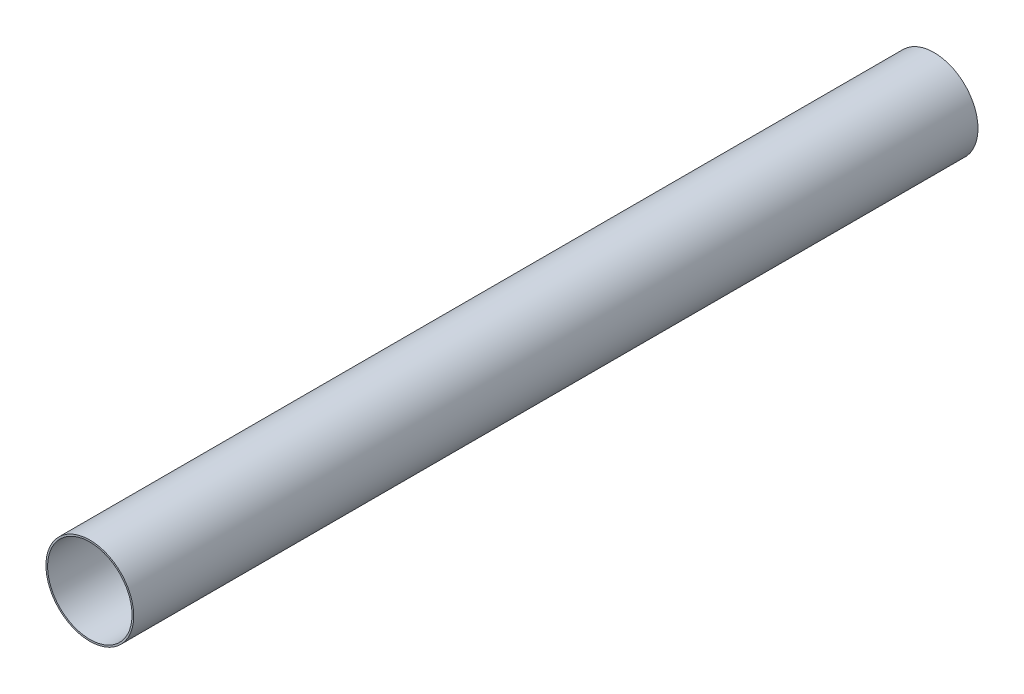
ISO-10303-21;
HEADER;
FILE_DESCRIPTION(('STEP AP214'),'2;1');
FILE_NAME('part.step','',(''),(''),'','','');
FILE_SCHEMA(('AUTOMOTIVE_DESIGN { 1 0 10303 214 1 1 1 1 }'));
ENDSEC;
DATA;
#1=APPLICATION_CONTEXT('core data for automotive mechanical design processes');
#2=APPLICATION_PROTOCOL_DEFINITION('international standard','automotive_design',2000,#1);
#3=PRODUCT_CONTEXT('',#1,'mechanical');
#4=PRODUCT('Part','Part','',(#3));
#5=PRODUCT_RELATED_PRODUCT_CATEGORY('part','',(#4));
#6=PRODUCT_DEFINITION_FORMATION('','',#4);
#7=PRODUCT_DEFINITION_CONTEXT('part definition',#1,'design');
#8=PRODUCT_DEFINITION('design','',#6,#7);
#9=PRODUCT_DEFINITION_SHAPE('','',#8);
#10=(LENGTH_UNIT() NAMED_UNIT(*) SI_UNIT(.MILLI.,.METRE.));
#11=(NAMED_UNIT(*) PLANE_ANGLE_UNIT() SI_UNIT($,.RADIAN.));
#12=(NAMED_UNIT(*) SI_UNIT($,.STERADIAN.) SOLID_ANGLE_UNIT());
#13=UNCERTAINTY_MEASURE_WITH_UNIT(LENGTH_MEASURE(1.E-05),#10,'distance_accuracy_value','');
#14=(GEOMETRIC_REPRESENTATION_CONTEXT(3) GLOBAL_UNCERTAINTY_ASSIGNED_CONTEXT((#13)) GLOBAL_UNIT_ASSIGNED_CONTEXT((#10,
#11,#12)) REPRESENTATION_CONTEXT('',''));
#15=CARTESIAN_POINT('',(0.,0.,0.));
#16=DIRECTION('',(0.,0.,1.));
#17=DIRECTION('',(1.,0.,0.));
#18=AXIS2_PLACEMENT_3D('',#15,#16,#17);
#19=CARTESIAN_POINT('',(0.,0.,1000.));
#20=DIRECTION('',(0.,0.,1.));
#21=DIRECTION('',(1.,0.,0.));
#22=AXIS2_PLACEMENT_3D('',#19,#20,#21);
#23=PLANE('',#22);
#24=CARTESIAN_POINT('',(0.,0.,1000.));
#25=DIRECTION('',(0.,0.,1.));
#26=DIRECTION('',(1.,0.,0.));
#27=AXIS2_PLACEMENT_3D('',#24,#25,#26);
#28=CIRCLE('',#27,52.);
#29=CARTESIAN_POINT('',(52.,0.,1000.));
#30=VERTEX_POINT('',#29);
#31=EDGE_CURVE('E10',#30,#30,#28,.T.);
#32=ORIENTED_EDGE('',*,*,#31,.T.);
#33=EDGE_LOOP('',(#32));
#34=FACE_BOUND('',#33,.T.);
#35=CARTESIAN_POINT('',(0.,0.,1000.));
#36=DIRECTION('',(0.,0.,1.));
#37=DIRECTION('',(1.,0.,0.));
#38=AXIS2_PLACEMENT_3D('',#35,#36,#37);
#39=CIRCLE('',#38,50.);
#40=CARTESIAN_POINT('',(50.,0.,1000.));
#41=VERTEX_POINT('',#40);
#42=EDGE_CURVE('E46',#41,#41,#39,.T.);
#43=ORIENTED_EDGE('',*,*,#42,.F.);
#44=EDGE_LOOP('',(#43));
#45=FACE_BOUND('',#44,.T.);
#46=ADVANCED_FACE('F35',(#34,#45),#23,.T.);
#47=CARTESIAN_POINT('',(0.,0.,0.));
#48=DIRECTION('',(0.,0.,1.));
#49=DIRECTION('',(1.,0.,0.));
#50=AXIS2_PLACEMENT_3D('',#47,#48,#49);
#51=PLANE('',#50);
#52=CARTESIAN_POINT('',(0.,0.,0.));
#53=DIRECTION('',(0.,0.,1.));
#54=DIRECTION('',(1.,0.,0.));
#55=AXIS2_PLACEMENT_3D('',#52,#53,#54);
#56=CIRCLE('',#55,52.);
#57=CARTESIAN_POINT('',(52.,0.,0.));
#58=VERTEX_POINT('',#57);
#59=EDGE_CURVE('E39',#58,#58,#56,.T.);
#60=ORIENTED_EDGE('',*,*,#59,.F.);
#61=EDGE_LOOP('',(#60));
#62=FACE_BOUND('',#61,.T.);
#63=CARTESIAN_POINT('',(0.,0.,0.));
#64=DIRECTION('',(0.,0.,1.));
#65=DIRECTION('',(1.,0.,0.));
#66=AXIS2_PLACEMENT_3D('',#63,#64,#65);
#67=CIRCLE('',#66,50.);
#68=CARTESIAN_POINT('',(50.,0.,0.));
#69=VERTEX_POINT('',#68);
#70=EDGE_CURVE('E48',#69,#69,#67,.T.);
#71=ORIENTED_EDGE('',*,*,#70,.T.);
#72=EDGE_LOOP('',(#71));
#73=FACE_BOUND('',#72,.T.);
#74=ADVANCED_FACE('F58',(#62,#73),#51,.F.);
#75=CARTESIAN_POINT('',(0.,0.,1000.));
#76=DIRECTION('',(0.,0.,-1.));
#77=DIRECTION('',(-1.,0.,0.));
#78=AXIS2_PLACEMENT_3D('',#75,#76,#77);
#79=CYLINDRICAL_SURFACE('',#78,52.);
#80=ORIENTED_EDGE('',*,*,#31,.F.);
#81=EDGE_LOOP('',(#80));
#82=FACE_BOUND('',#81,.T.);
#83=ORIENTED_EDGE('',*,*,#59,.T.);
#84=EDGE_LOOP('',(#83));
#85=FACE_BOUND('',#84,.T.);
#86=ADVANCED_FACE('F37',(#82,#85),#79,.T.);
#87=CARTESIAN_POINT('',(0.,0.,1000.));
#88=DIRECTION('',(0.,0.,-1.));
#89=DIRECTION('',(-1.,0.,0.));
#90=AXIS2_PLACEMENT_3D('',#87,#88,#89);
#91=CYLINDRICAL_SURFACE('',#90,50.);
#92=ORIENTED_EDGE('',*,*,#42,.T.);
#93=EDGE_LOOP('',(#92));
#94=FACE_BOUND('',#93,.T.);
#95=ORIENTED_EDGE('',*,*,#70,.F.);
#96=EDGE_LOOP('',(#95));
#97=FACE_BOUND('',#96,.T.);
#98=ADVANCED_FACE('F54',(#94,#97),#91,.F.);
#99=CLOSED_SHELL('',(#46,#74,#86,#98));
#100=MANIFOLD_SOLID_BREP('B2',#99);
#101=ADVANCED_BREP_SHAPE_REPRESENTATION('',(#18,#100),#14);
#102=SHAPE_DEFINITION_REPRESENTATION(#9,#101);
ENDSEC;
END-ISO-10303-21;
